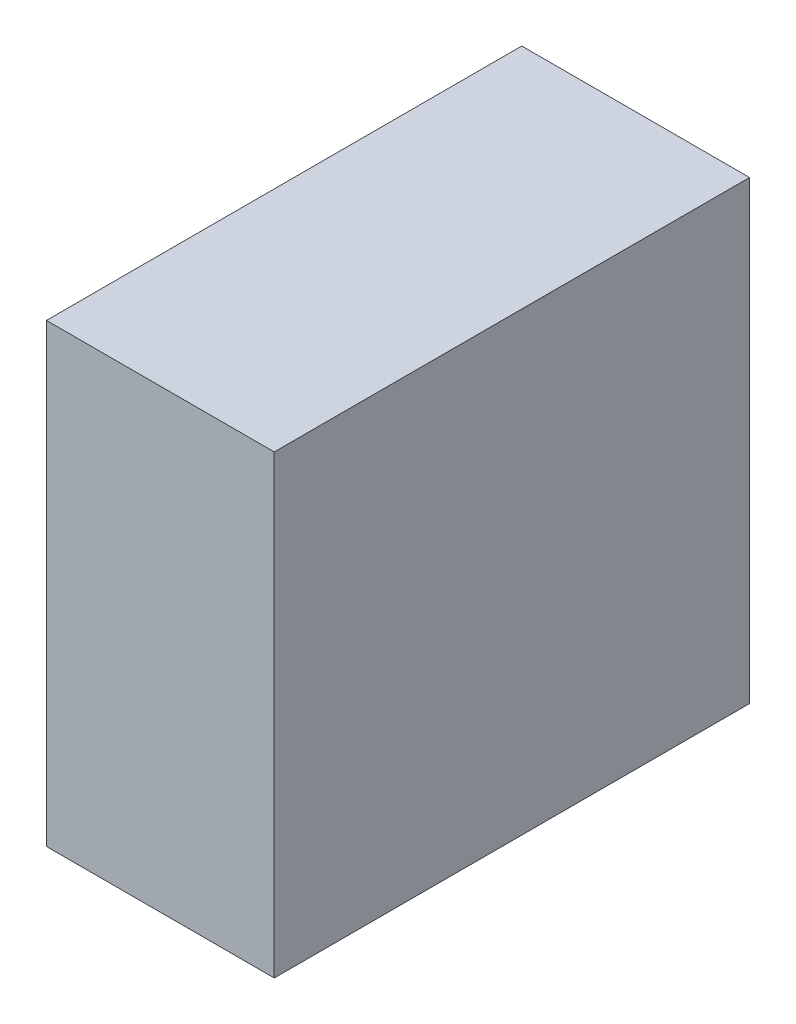
ISO-10303-21;
HEADER;
FILE_DESCRIPTION(('STEP AP214'),'2;1');
FILE_NAME('part.step','',(''),(''),'','','');
FILE_SCHEMA(('AUTOMOTIVE_DESIGN { 1 0 10303 214 1 1 1 1 }'));
ENDSEC;
DATA;
#1=APPLICATION_CONTEXT('core data for automotive mechanical design processes');
#2=APPLICATION_PROTOCOL_DEFINITION('international standard','automotive_design',2000,#1);
#3=PRODUCT_CONTEXT('',#1,'mechanical');
#4=PRODUCT('Part','Part','',(#3));
#5=PRODUCT_RELATED_PRODUCT_CATEGORY('part','',(#4));
#6=PRODUCT_DEFINITION_FORMATION('','',#4);
#7=PRODUCT_DEFINITION_CONTEXT('part definition',#1,'design');
#8=PRODUCT_DEFINITION('design','',#6,#7);
#9=PRODUCT_DEFINITION_SHAPE('','',#8);
#10=(LENGTH_UNIT() NAMED_UNIT(*) SI_UNIT(.MILLI.,.METRE.));
#11=(NAMED_UNIT(*) PLANE_ANGLE_UNIT() SI_UNIT($,.RADIAN.));
#12=(NAMED_UNIT(*) SI_UNIT($,.STERADIAN.) SOLID_ANGLE_UNIT());
#13=UNCERTAINTY_MEASURE_WITH_UNIT(LENGTH_MEASURE(1.E-05),#10,'distance_accuracy_value','');
#14=(GEOMETRIC_REPRESENTATION_CONTEXT(3) GLOBAL_UNCERTAINTY_ASSIGNED_CONTEXT((#13)) GLOBAL_UNIT_ASSIGNED_CONTEXT((#10,
#11,#12)) REPRESENTATION_CONTEXT('',''));
#15=CARTESIAN_POINT('',(0.,0.,0.));
#16=DIRECTION('',(0.,0.,1.));
#17=DIRECTION('',(1.,0.,0.));
#18=AXIS2_PLACEMENT_3D('',#15,#16,#17);
#19=CARTESIAN_POINT('',(-0.127,0.254,0.));
#20=DIRECTION('',(1.,0.,0.));
#21=DIRECTION('',(0.,0.,-1.));
#22=AXIS2_PLACEMENT_3D('',#19,#20,#21);
#23=PLANE('',#22);
#24=DIRECTION('',(0.,0.,1.));
#25=VECTOR('',#24,1.);
#26=CARTESIAN_POINT('',(-0.127,-0.254,0.));
#27=LINE('',#26,#25);
#28=CARTESIAN_POINT('',(-0.127,-0.254,0.));
#29=VERTEX_POINT('',#28);
#30=CARTESIAN_POINT('',(-0.127,-0.254,0.52999894));
#31=VERTEX_POINT('',#30);
#32=EDGE_CURVE('E20',#29,#31,#27,.T.);
#33=ORIENTED_EDGE('',*,*,#32,.T.);
#34=DIRECTION('',(0.,1.,0.));
#35=VECTOR('',#34,1.);
#36=CARTESIAN_POINT('',(-0.127,-0.254,0.52999894));
#37=LINE('',#36,#35);
#38=CARTESIAN_POINT('',(-0.127,0.254,0.52999894));
#39=VERTEX_POINT('',#38);
#40=EDGE_CURVE('E55',#31,#39,#37,.T.);
#41=ORIENTED_EDGE('',*,*,#40,.T.);
#42=DIRECTION('',(0.,0.,-1.));
#43=VECTOR('',#42,1.);
#44=CARTESIAN_POINT('',(-0.127,0.254,0.));
#45=LINE('',#44,#43);
#46=CARTESIAN_POINT('',(-0.127,0.254,0.));
#47=VERTEX_POINT('',#46);
#48=EDGE_CURVE('E76',#39,#47,#45,.T.);
#49=ORIENTED_EDGE('',*,*,#48,.T.);
#50=DIRECTION('',(0.,1.,0.));
#51=VECTOR('',#50,1.);
#52=CARTESIAN_POINT('',(-0.127,-0.254,0.));
#53=LINE('',#52,#51);
#54=EDGE_CURVE('E58',#29,#47,#53,.T.);
#55=ORIENTED_EDGE('',*,*,#54,.F.);
#56=EDGE_LOOP('',(#33,#41,#49,#55));
#57=FACE_BOUND('',#56,.T.);
#58=ADVANCED_FACE('F17',(#57),#23,.F.);
#59=CARTESIAN_POINT('',(-0.127,-0.254,0.));
#60=DIRECTION('',(0.,1.,0.));
#61=DIRECTION('',(0.,0.,1.));
#62=AXIS2_PLACEMENT_3D('',#59,#60,#61);
#63=PLANE('',#62);
#64=DIRECTION('',(0.,0.,1.));
#65=VECTOR('',#64,1.);
#66=CARTESIAN_POINT('',(0.127,-0.254,0.));
#67=LINE('',#66,#65);
#68=CARTESIAN_POINT('',(0.127,-0.254,0.));
#69=VERTEX_POINT('',#68);
#70=CARTESIAN_POINT('',(0.127,-0.254,0.52999894));
#71=VERTEX_POINT('',#70);
#72=EDGE_CURVE('E73',#69,#71,#67,.T.);
#73=ORIENTED_EDGE('',*,*,#72,.T.);
#74=DIRECTION('',(-1.,0.,0.));
#75=VECTOR('',#74,1.);
#76=CARTESIAN_POINT('',(0.127,-0.254,0.52999894));
#77=LINE('',#76,#75);
#78=EDGE_CURVE('E63',#71,#31,#77,.T.);
#79=ORIENTED_EDGE('',*,*,#78,.T.);
#80=ORIENTED_EDGE('',*,*,#32,.F.);
#81=DIRECTION('',(-1.,0.,0.));
#82=VECTOR('',#81,1.);
#83=CARTESIAN_POINT('',(0.127,-0.254,0.));
#84=LINE('',#83,#82);
#85=EDGE_CURVE('E78',#69,#29,#84,.T.);
#86=ORIENTED_EDGE('',*,*,#85,.F.);
#87=EDGE_LOOP('',(#73,#79,#80,#86));
#88=FACE_BOUND('',#87,.T.);
#89=ADVANCED_FACE('F72',(#88),#63,.F.);
#90=CARTESIAN_POINT('',(0.127,-0.254,0.52999894));
#91=DIRECTION('',(0.,0.,-1.));
#92=DIRECTION('',(-1.,0.,0.));
#93=AXIS2_PLACEMENT_3D('',#90,#91,#92);
#94=PLANE('',#93);
#95=DIRECTION('',(1.,0.,0.));
#96=VECTOR('',#95,1.);
#97=CARTESIAN_POINT('',(0.127,0.254,0.52999894));
#98=LINE('',#97,#96);
#99=CARTESIAN_POINT('',(0.127,0.254,0.52999894));
#100=VERTEX_POINT('',#99);
#101=EDGE_CURVE('E69',#100,#39,#98,.F.);
#102=ORIENTED_EDGE('',*,*,#101,.T.);
#103=ORIENTED_EDGE('',*,*,#40,.F.);
#104=ORIENTED_EDGE('',*,*,#78,.F.);
#105=DIRECTION('',(0.,1.,0.));
#106=VECTOR('',#105,1.);
#107=CARTESIAN_POINT('',(0.127,-0.254,0.52999894));
#108=LINE('',#107,#106);
#109=EDGE_CURVE('E83',#71,#100,#108,.T.);
#110=ORIENTED_EDGE('',*,*,#109,.T.);
#111=EDGE_LOOP('',(#102,#103,#104,#110));
#112=FACE_BOUND('',#111,.T.);
#113=ADVANCED_FACE('F66',(#112),#94,.F.);
#114=CARTESIAN_POINT('',(0.127,0.254,0.));
#115=DIRECTION('',(0.,-1.,0.));
#116=DIRECTION('',(0.,0.,-1.));
#117=AXIS2_PLACEMENT_3D('',#114,#115,#116);
#118=PLANE('',#117);
#119=ORIENTED_EDGE('',*,*,#48,.F.);
#120=ORIENTED_EDGE('',*,*,#101,.F.);
#121=DIRECTION('',(0.,0.,1.));
#122=VECTOR('',#121,1.);
#123=CARTESIAN_POINT('',(0.127,0.254,0.));
#124=LINE('',#123,#122);
#125=CARTESIAN_POINT('',(0.127,0.254,0.));
#126=VERTEX_POINT('',#125);
#127=EDGE_CURVE('E26',#100,#126,#124,.F.);
#128=ORIENTED_EDGE('',*,*,#127,.T.);
#129=DIRECTION('',(-1.,0.,0.));
#130=VECTOR('',#129,1.);
#131=CARTESIAN_POINT('',(0.127,0.254,0.));
#132=LINE('',#131,#130);
#133=EDGE_CURVE('E34',#47,#126,#132,.F.);
#134=ORIENTED_EDGE('',*,*,#133,.F.);
#135=EDGE_LOOP('',(#119,#120,#128,#134));
#136=FACE_BOUND('',#135,.T.);
#137=ADVANCED_FACE('F88',(#136),#118,.F.);
#138=CARTESIAN_POINT('',(0.127,-0.254,0.));
#139=DIRECTION('',(0.,0.,-1.));
#140=DIRECTION('',(-1.,0.,0.));
#141=AXIS2_PLACEMENT_3D('',#138,#139,#140);
#142=PLANE('',#141);
#143=ORIENTED_EDGE('',*,*,#133,.T.);
#144=DIRECTION('',(0.,1.,0.));
#145=VECTOR('',#144,1.);
#146=CARTESIAN_POINT('',(0.127,-0.254,0.));
#147=LINE('',#146,#145);
#148=EDGE_CURVE('E11',#126,#69,#147,.F.);
#149=ORIENTED_EDGE('',*,*,#148,.T.);
#150=ORIENTED_EDGE('',*,*,#85,.T.);
#151=ORIENTED_EDGE('',*,*,#54,.T.);
#152=EDGE_LOOP('',(#143,#149,#150,#151));
#153=FACE_BOUND('',#152,.T.);
#154=ADVANCED_FACE('F91',(#153),#142,.T.);
#155=CARTESIAN_POINT('',(0.127,-0.254,0.));
#156=DIRECTION('',(-1.,0.,0.));
#157=DIRECTION('',(0.,0.,1.));
#158=AXIS2_PLACEMENT_3D('',#155,#156,#157);
#159=PLANE('',#158);
#160=ORIENTED_EDGE('',*,*,#127,.F.);
#161=ORIENTED_EDGE('',*,*,#109,.F.);
#162=ORIENTED_EDGE('',*,*,#72,.F.);
#163=ORIENTED_EDGE('',*,*,#148,.F.);
#164=EDGE_LOOP('',(#160,#161,#162,#163));
#165=FACE_BOUND('',#164,.T.);
#166=ADVANCED_FACE('F90',(#165),#159,.F.);
#167=CLOSED_SHELL('',(#58,#89,#113,#137,#154,#166));
#168=MANIFOLD_SOLID_BREP('B1',#167);
#169=ADVANCED_BREP_SHAPE_REPRESENTATION('',(#18,#168),#14);
#170=SHAPE_DEFINITION_REPRESENTATION(#9,#169);
ENDSEC;
END-ISO-10303-21;
